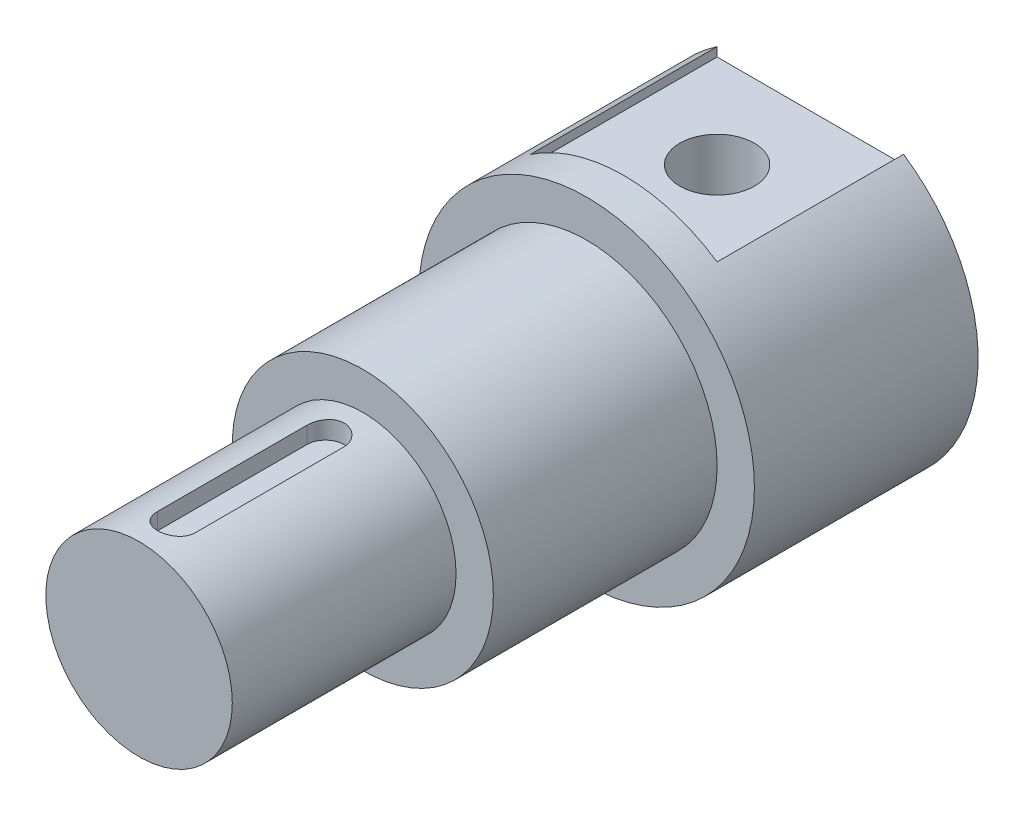
ISO-10303-21;
HEADER;
FILE_DESCRIPTION(('STEP AP214'),'2;1');
FILE_NAME('part.step','',(''),(''),'','','');
FILE_SCHEMA(('AUTOMOTIVE_DESIGN { 1 0 10303 214 1 1 1 1 }'));
ENDSEC;
DATA;
#1=APPLICATION_CONTEXT('core data for automotive mechanical design processes');
#2=APPLICATION_PROTOCOL_DEFINITION('international standard','automotive_design',2000,#1);
#3=PRODUCT_CONTEXT('',#1,'mechanical');
#4=PRODUCT('Part','Part','',(#3));
#5=PRODUCT_RELATED_PRODUCT_CATEGORY('part','',(#4));
#6=PRODUCT_DEFINITION_FORMATION('','',#4);
#7=PRODUCT_DEFINITION_CONTEXT('part definition',#1,'design');
#8=PRODUCT_DEFINITION('design','',#6,#7);
#9=PRODUCT_DEFINITION_SHAPE('','',#8);
#10=(LENGTH_UNIT() NAMED_UNIT(*) SI_UNIT(.MILLI.,.METRE.));
#11=(NAMED_UNIT(*) PLANE_ANGLE_UNIT() SI_UNIT($,.RADIAN.));
#12=(NAMED_UNIT(*) SI_UNIT($,.STERADIAN.) SOLID_ANGLE_UNIT());
#13=UNCERTAINTY_MEASURE_WITH_UNIT(LENGTH_MEASURE(1.E-05),#10,'distance_accuracy_value','');
#14=(GEOMETRIC_REPRESENTATION_CONTEXT(3) GLOBAL_UNCERTAINTY_ASSIGNED_CONTEXT((#13)) GLOBAL_UNIT_ASSIGNED_CONTEXT((#10,
#11,#12)) REPRESENTATION_CONTEXT('',''));
#15=CARTESIAN_POINT('',(0.,0.,0.));
#16=DIRECTION('',(0.,0.,1.));
#17=DIRECTION('',(1.,0.,0.));
#18=AXIS2_PLACEMENT_3D('',#15,#16,#17);
#19=CARTESIAN_POINT('',(0.,0.,24.));
#20=DIRECTION('',(0.,0.,-1.));
#21=DIRECTION('',(-1.,0.,0.));
#22=AXIS2_PLACEMENT_3D('',#19,#20,#21);
#23=CYLINDRICAL_SURFACE('',#22,18.);
#24=CARTESIAN_POINT('',(0.,0.,24.));
#25=DIRECTION('',(0.,0.,1.));
#26=DIRECTION('',(1.,0.,0.));
#27=AXIS2_PLACEMENT_3D('',#24,#25,#26);
#28=CIRCLE('',#27,18.);
#29=CARTESIAN_POINT('',(18.,0.,24.));
#30=VERTEX_POINT('',#29);
#31=EDGE_CURVE('E309',#30,#30,#28,.T.);
#32=ORIENTED_EDGE('',*,*,#31,.F.);
#33=EDGE_LOOP('',(#32));
#34=FACE_BOUND('',#33,.T.);
#35=CARTESIAN_POINT('',(0.,0.,20.));
#36=DIRECTION('',(0.,0.,-1.));
#37=DIRECTION('',(-1.,0.,0.));
#38=AXIS2_PLACEMENT_3D('',#35,#36,#37);
#39=CIRCLE('',#38,18.);
#40=CARTESIAN_POINT('',(10.,-14.9666295470958,20.));
#41=VERTEX_POINT('',#40);
#42=CARTESIAN_POINT('',(-10.,-14.9666295470958,20.));
#43=VERTEX_POINT('',#42);
#44=EDGE_CURVE('E11',#41,#43,#39,.T.);
#45=ORIENTED_EDGE('',*,*,#44,.F.);
#46=DIRECTION('',(0.,0.,-1.));
#47=VECTOR('',#46,1.);
#48=CARTESIAN_POINT('',(10.,-14.9666295470958,24.));
#49=LINE('',#48,#47);
#50=CARTESIAN_POINT('',(10.,-14.9666295470958,0.));
#51=VERTEX_POINT('',#50);
#52=EDGE_CURVE('E182',#51,#41,#49,.F.);
#53=ORIENTED_EDGE('',*,*,#52,.F.);
#54=CARTESIAN_POINT('',(0.,0.,0.));
#55=DIRECTION('',(0.,0.,1.));
#56=DIRECTION('',(1.,0.,0.));
#57=AXIS2_PLACEMENT_3D('',#54,#55,#56);
#58=CIRCLE('',#57,18.);
#59=CARTESIAN_POINT('',(10.,14.9666295470958,0.));
#60=VERTEX_POINT('',#59);
#61=EDGE_CURVE('E305',#51,#60,#58,.T.);
#62=ORIENTED_EDGE('',*,*,#61,.T.);
#63=DIRECTION('',(0.,0.,-1.));
#64=VECTOR('',#63,1.);
#65=CARTESIAN_POINT('',(10.,14.9666295470958,24.));
#66=LINE('',#65,#64);
#67=CARTESIAN_POINT('',(10.,14.9666295470958,20.));
#68=VERTEX_POINT('',#67);
#69=EDGE_CURVE('E212',#60,#68,#66,.F.);
#70=ORIENTED_EDGE('',*,*,#69,.T.);
#71=CARTESIAN_POINT('',(0.,0.,20.));
#72=DIRECTION('',(0.,0.,1.));
#73=DIRECTION('',(1.,0.,0.));
#74=AXIS2_PLACEMENT_3D('',#71,#72,#73);
#75=CIRCLE('',#74,18.);
#76=CARTESIAN_POINT('',(-10.,14.9666295470958,20.));
#77=VERTEX_POINT('',#76);
#78=EDGE_CURVE('E55',#68,#77,#75,.T.);
#79=ORIENTED_EDGE('',*,*,#78,.T.);
#80=DIRECTION('',(0.,0.,-1.));
#81=VECTOR('',#80,1.);
#82=CARTESIAN_POINT('',(-10.,14.9666295470958,24.));
#83=LINE('',#82,#81);
#84=CARTESIAN_POINT('',(-10.,14.9666295470958,0.));
#85=VERTEX_POINT('',#84);
#86=EDGE_CURVE('E227',#77,#85,#83,.T.);
#87=ORIENTED_EDGE('',*,*,#86,.T.);
#88=CARTESIAN_POINT('',(-10.,-14.9666295470958,0.));
#89=VERTEX_POINT('',#88);
#90=EDGE_CURVE('E313',#85,#89,#58,.T.);
#91=ORIENTED_EDGE('',*,*,#90,.T.);
#92=DIRECTION('',(0.,0.,-1.));
#93=VECTOR('',#92,1.);
#94=CARTESIAN_POINT('',(-10.,-14.9666295470958,24.));
#95=LINE('',#94,#93);
#96=EDGE_CURVE('E188',#43,#89,#95,.T.);
#97=ORIENTED_EDGE('',*,*,#96,.F.);
#98=EDGE_LOOP('',(#45,#53,#62,#70,#79,#87,#91,#97));
#99=FACE_BOUND('',#98,.T.);
#100=ADVANCED_FACE('F47',(#34,#99),#23,.T.);
#101=CARTESIAN_POINT('',(0.,0.,0.));
#102=DIRECTION('',(0.,0.,1.));
#103=DIRECTION('',(1.,0.,0.));
#104=AXIS2_PLACEMENT_3D('',#101,#102,#103);
#105=PLANE('',#104);
#106=DIRECTION('',(0.,-1.,0.));
#107=VECTOR('',#106,1.);
#108=CARTESIAN_POINT('',(-10.,-14.,0.));
#109=LINE('',#108,#107);
#110=CARTESIAN_POINT('',(-10.,-14.,0.));
#111=VERTEX_POINT('',#110);
#112=EDGE_CURVE('E175',#111,#89,#109,.T.);
#113=ORIENTED_EDGE('',*,*,#112,.T.);
#114=ORIENTED_EDGE('',*,*,#90,.F.);
#115=DIRECTION('',(0.,1.,0.));
#116=VECTOR('',#115,1.);
#117=CARTESIAN_POINT('',(-10.,14.,0.));
#118=LINE('',#117,#116);
#119=CARTESIAN_POINT('',(-10.,14.,0.));
#120=VERTEX_POINT('',#119);
#121=EDGE_CURVE('E209',#120,#85,#118,.T.);
#122=ORIENTED_EDGE('',*,*,#121,.F.);
#123=DIRECTION('',(-1.,0.,0.));
#124=VECTOR('',#123,1.);
#125=CARTESIAN_POINT('',(-10.,14.,0.));
#126=LINE('',#125,#124);
#127=CARTESIAN_POINT('',(10.,14.,0.));
#128=VERTEX_POINT('',#127);
#129=EDGE_CURVE('E205',#128,#120,#126,.T.);
#130=ORIENTED_EDGE('',*,*,#129,.F.);
#131=DIRECTION('',(0.,1.,0.));
#132=VECTOR('',#131,1.);
#133=CARTESIAN_POINT('',(10.,14.,0.));
#134=LINE('',#133,#132);
#135=EDGE_CURVE('E213',#128,#60,#134,.T.);
#136=ORIENTED_EDGE('',*,*,#135,.T.);
#137=ORIENTED_EDGE('',*,*,#61,.F.);
#138=DIRECTION('',(0.,-1.,0.));
#139=VECTOR('',#138,1.);
#140=CARTESIAN_POINT('',(10.,-14.,0.));
#141=LINE('',#140,#139);
#142=CARTESIAN_POINT('',(10.,-14.,0.));
#143=VERTEX_POINT('',#142);
#144=EDGE_CURVE('E190',#143,#51,#141,.T.);
#145=ORIENTED_EDGE('',*,*,#144,.F.);
#146=DIRECTION('',(-1.,0.,0.));
#147=VECTOR('',#146,1.);
#148=CARTESIAN_POINT('',(-10.,-14.,0.));
#149=LINE('',#148,#147);
#150=EDGE_CURVE('E379',#143,#111,#149,.T.);
#151=ORIENTED_EDGE('',*,*,#150,.T.);
#152=EDGE_LOOP('',(#113,#114,#122,#130,#136,#137,#145,#151));
#153=FACE_BOUND('',#152,.T.);
#154=ADVANCED_FACE('F363',(#153),#105,.F.);
#155=CARTESIAN_POINT('',(0.,0.,72.));
#156=DIRECTION('',(0.,0.,-1.));
#157=DIRECTION('',(-1.,0.,0.));
#158=AXIS2_PLACEMENT_3D('',#155,#156,#157);
#159=CYLINDRICAL_SURFACE('',#158,10.);
#160=DIRECTION('',(0.,0.,-1.));
#161=VECTOR('',#160,1.);
#162=CARTESIAN_POINT('',(2.00000000000001,9.79795897113271,72.));
#163=LINE('',#162,#161);
#164=CARTESIAN_POINT('',(2.00000000000002,9.79795897113271,52.));
#165=VERTEX_POINT('',#164);
#166=CARTESIAN_POINT('',(2.00000000000001,9.79795897113271,68.));
#167=VERTEX_POINT('',#166);
#168=EDGE_CURVE('E450',#165,#167,#163,.F.);
#169=ORIENTED_EDGE('',*,*,#168,.T.);
#170=CARTESIAN_POINT('',(2.00000000000002,9.79795897113271,68.));
#171=CARTESIAN_POINT('',(2.00000029709048,9.79795611157838,68.0556671372987));
#172=CARTESIAN_POINT('',(1.99767440405644,9.79843398465431,68.1113070388049));
#173=CARTESIAN_POINT('',(1.9883998682916,9.80032138150132,68.2221774356675));
#174=CARTESIAN_POINT('',(1.98145179742021,9.80173079002197,68.2774079808152));
#175=CARTESIAN_POINT('',(1.95376239954906,9.8073028328515,68.4417098803016));
#176=CARTESIAN_POINT('',(1.9261755529756,9.81280956758554,68.5496628575345));
#177=CARTESIAN_POINT('',(1.85359362042641,9.8267766040168,68.7592851934839));
#178=CARTESIAN_POINT('',(1.8085966127526,9.83523723174863,68.8609538571135));
#179=CARTESIAN_POINT('',(1.70250820881973,9.85415440257657,69.0553297677597));
#180=CARTESIAN_POINT('',(1.64141514447464,9.86461115250626,69.1480360846177));
#181=CARTESIAN_POINT('',(1.50396101869287,9.88650550448304,69.3231196733701));
#182=CARTESIAN_POINT('',(1.42741780364328,9.89795377776164,69.4053525644588));
#183=CARTESIAN_POINT('',(1.26162118198371,9.92044851228358,69.5559088785751));
#184=CARTESIAN_POINT('',(1.17236580968337,9.93149491105252,69.624230146461));
#185=CARTESIAN_POINT('',(0.9827201068006,9.95205620855081,69.7455778018475));
#186=CARTESIAN_POINT('',(0.882239649549993,9.96155694564014,69.7984659384246));
#187=CARTESIAN_POINT('',(0.673602404217804,9.97783510908995,69.8865517690996));
#188=CARTESIAN_POINT('',(0.565446754297834,9.9846129382442,69.9217520799118));
#189=CARTESIAN_POINT('',(0.34603481777421,9.99460635553984,69.9730140969379));
#190=CARTESIAN_POINT('',(0.234838069152001,9.99786765043076,69.9893215789678));
#191=CARTESIAN_POINT('',(0.0112397534982689,10.0006184349224,70.0031019588768));
#192=CARTESIAN_POINT('',(-0.10116172478384,10.000108200481,70.0005762347569));
#193=CARTESIAN_POINT('',(-0.322284405513379,9.99540868887644,69.9769475992568));
#194=CARTESIAN_POINT('',(-0.431035226714456,9.9912719366342,69.9561099001905));
#195=CARTESIAN_POINT('',(-0.643464013108165,9.97984349003516,69.8968696460479));
#196=CARTESIAN_POINT('',(-0.747141812282543,9.97255169250401,69.8584665165555));
#197=CARTESIAN_POINT('',(-0.947240542625918,9.95554578241051,69.7649391930093));
#198=CARTESIAN_POINT('',(-1.04361145363294,9.94581664782192,69.7097108261481));
#199=CARTESIAN_POINT('',(-1.22581287576612,9.92500903258345,69.5841794594467));
#200=CARTESIAN_POINT('',(-1.31164251244036,9.91393044014086,69.5138752103125));
#201=CARTESIAN_POINT('',(-1.47189241307715,9.8914207473701,69.3587432767496));
#202=CARTESIAN_POINT('',(-1.54608938999208,9.8799868648348,69.2736851958569));
#203=CARTESIAN_POINT('',(-1.6792217997989,9.85823412232848,69.0921904830223));
#204=CARTESIAN_POINT('',(-1.73815300484307,9.84791557170815,68.9957507096675));
#205=CARTESIAN_POINT('',(-1.83915990928954,9.82955460084642,68.7938951901082));
#206=CARTESIAN_POINT('',(-1.88118975326901,9.8215183899669,68.6884559532069));
#207=CARTESIAN_POINT('',(-1.94681419465983,9.80872322124987,68.4718827374886));
#208=CARTESIAN_POINT('',(-1.97043625496866,9.80395938256574,68.3607575067038));
#209=CARTESIAN_POINT('',(-1.98966587624393,9.80006354383926,68.2072863663072));
#210=CARTESIAN_POINT('',(-1.99354251131102,9.79927519743986,68.1658917204352));
#211=CARTESIAN_POINT('',(-1.9987063293293,9.79822334773544,68.0830042717252));
#212=CARTESIAN_POINT('',(-1.99999784580931,9.79795896609649,68.0415117500884));
#213=CARTESIAN_POINT('',(-2.,9.79795897113271,68.));
#214=B_SPLINE_CURVE_WITH_KNOTS('',3,(#170,#171,#172,#173,#174,#175,#176,#177,#178,#179,#180,
#181,#182,#183,#184,#185,#186,#187,#188,#189,#190,#191,#192,#193,#194,#195,#196,#197,#198,#199,
#200,#201,#202,#203,#204,#205,#206,#207,#208,#209,#210,#211,#212,#213),.UNSPECIFIED.,.F.,.F.,(4,
2,2,2,2,2,2,2,2,2,2,2,2,2,2,2,2,2,2,2,2,4),(0.,0.166897020715831,0.333773396643063,
0.666722601037227,0.999708566174129,1.33272905329864,1.6699328893144,2.00718892413593,
2.34737937755196,2.68751948879681,3.02318320738909,3.35882236614865,3.6896791255544,
4.02054670525123,4.35350597112355,4.6864928390181,5.02524540329294,5.36409168485664,
5.70385119298731,6.04310283225107,6.16778801087552,6.292263999539),.UNSPECIFIED.);
#215=CARTESIAN_POINT('',(-2.,9.79795897113271,68.));
#216=VERTEX_POINT('',#215);
#217=EDGE_CURVE('E300',#167,#216,#214,.T.);
#218=ORIENTED_EDGE('',*,*,#217,.T.);
#219=DIRECTION('',(0.,0.,-1.));
#220=VECTOR('',#219,1.);
#221=CARTESIAN_POINT('',(-2.00000000000001,9.79795897113271,72.));
#222=LINE('',#221,#220);
#223=CARTESIAN_POINT('',(-2.00000000000001,9.79795897113271,52.));
#224=VERTEX_POINT('',#223);
#225=EDGE_CURVE('E478',#216,#224,#222,.T.);
#226=ORIENTED_EDGE('',*,*,#225,.T.);
#227=CARTESIAN_POINT('',(-2.,9.79795897113271,52.));
#228=CARTESIAN_POINT('',(-2.00000029709046,9.79795611157838,51.9443328627013));
#229=CARTESIAN_POINT('',(-1.99767440405642,9.79843398465431,51.8886929611951));
#230=CARTESIAN_POINT('',(-1.98839986829158,9.80032138150132,51.7778225643325));
#231=CARTESIAN_POINT('',(-1.98145179742019,9.80173079002197,51.7225920191848));
#232=CARTESIAN_POINT('',(-1.95376239954903,9.8073028328515,51.5582901196984));
#233=CARTESIAN_POINT('',(-1.92617555297558,9.81280956758554,51.4503371424655));
#234=CARTESIAN_POINT('',(-1.85359362042638,9.8267766040168,51.2407148065161));
#235=CARTESIAN_POINT('',(-1.80859661275257,9.83523723174864,51.1390461428865));
#236=CARTESIAN_POINT('',(-1.7025082088197,9.85415440257657,50.9446702322403));
#237=CARTESIAN_POINT('',(-1.64141514447461,9.86461115250626,50.8519639153823));
#238=CARTESIAN_POINT('',(-1.50396101869285,9.88650550448304,50.6768803266299));
#239=CARTESIAN_POINT('',(-1.42741780364326,9.89795377776164,50.5946474355412));
#240=CARTESIAN_POINT('',(-1.26162118198369,9.92044851228359,50.4440911214249));
#241=CARTESIAN_POINT('',(-1.17236580968335,9.93149491105252,50.375769853539));
#242=CARTESIAN_POINT('',(-0.982720106800585,9.95205620855081,50.2544221981525));
#243=CARTESIAN_POINT('',(-0.882239649549981,9.96155694564014,50.2015340615754));
#244=CARTESIAN_POINT('',(-0.673602404217792,9.97783510908995,50.1134482309004));
#245=CARTESIAN_POINT('',(-0.565446754297821,9.9846129382442,50.0782479200882));
#246=CARTESIAN_POINT('',(-0.346034817774195,9.99460635553984,50.0269859030621));
#247=CARTESIAN_POINT('',(-0.234838069151986,9.99786765043076,50.0106784210322));
#248=CARTESIAN_POINT('',(-0.0112397534982542,10.0006184349224,49.9968980411232));
#249=CARTESIAN_POINT('',(0.101161724783855,10.000108200481,49.9994237652431));
#250=CARTESIAN_POINT('',(0.322284405513394,9.99540868887644,50.0230524007432));
#251=CARTESIAN_POINT('',(0.431035226714469,9.9912719366342,50.0438900998095));
#252=CARTESIAN_POINT('',(0.643464013108179,9.97984349003515,50.1031303539521));
#253=CARTESIAN_POINT('',(0.747141812282559,9.97255169250401,50.1415334834445));
#254=CARTESIAN_POINT('',(0.947240542625932,9.95554578241051,50.2350608069907));
#255=CARTESIAN_POINT('',(1.04361145363296,9.94581664782193,50.2902891738519));
#256=CARTESIAN_POINT('',(1.22581287576613,9.92500903258345,50.4158205405533));
#257=CARTESIAN_POINT('',(1.31164251244038,9.91393044014085,50.4861247896875));
#258=CARTESIAN_POINT('',(1.47189241307717,9.89142074737009,50.6412567232504));
#259=CARTESIAN_POINT('',(1.5460893899921,9.87998686483479,50.7263148041431));
#260=CARTESIAN_POINT('',(1.67922179979891,9.85823412232847,50.9078095169778));
#261=CARTESIAN_POINT('',(1.73815300484308,9.84791557170815,51.0042492903325));
#262=CARTESIAN_POINT('',(1.83915990928956,9.82955460084642,51.2061048098918));
#263=CARTESIAN_POINT('',(1.88118975326902,9.8215183899669,51.3115440467931));
#264=CARTESIAN_POINT('',(1.94681419465985,9.80872322124987,51.5281172625114));
#265=CARTESIAN_POINT('',(1.97043625496868,9.80395938256574,51.6392424932963));
#266=CARTESIAN_POINT('',(1.98966587624396,9.80006354383926,51.7927136336929));
#267=CARTESIAN_POINT('',(1.99354251131105,9.79927519743985,51.8341082795649));
#268=CARTESIAN_POINT('',(1.99870632932933,9.79822334773543,51.9169957282748));
#269=CARTESIAN_POINT('',(1.99999784580933,9.79795896609649,51.9584882499116));
#270=CARTESIAN_POINT('',(2.00000000000002,9.79795897113271,52.));
#271=B_SPLINE_CURVE_WITH_KNOTS('',3,(#227,#228,#229,#230,#231,#232,#233,#234,#235,#236,#237,
#238,#239,#240,#241,#242,#243,#244,#245,#246,#247,#248,#249,#250,#251,#252,#253,#254,#255,#256,
#257,#258,#259,#260,#261,#262,#263,#264,#265,#266,#267,#268,#269,#270),.UNSPECIFIED.,.F.,.F.,(4,
2,2,2,2,2,2,2,2,2,2,2,2,2,2,2,2,2,2,2,2,4),(0.,0.166897020715838,0.33377339664307,
0.666722601037227,0.999708566174154,1.33272905329864,1.6699328893144,2.00718892413592,
2.34737937755194,2.6875194887968,3.02318320738908,3.35882236614864,3.68967912555439,
4.02054670525122,4.35350597112354,4.68649283901809,5.02524540329295,5.36409168485662,
5.7038511929873,6.04310283225108,6.16778801087555,6.29226399953903),.UNSPECIFIED.);
#272=EDGE_CURVE('E326',#224,#165,#271,.T.);
#273=ORIENTED_EDGE('',*,*,#272,.T.);
#274=EDGE_LOOP('',(#169,#218,#226,#273));
#275=FACE_BOUND('',#274,.T.);
#276=CARTESIAN_POINT('',(0.,0.,72.));
#277=DIRECTION('',(0.,0.,1.));
#278=DIRECTION('',(1.,0.,0.));
#279=AXIS2_PLACEMENT_3D('',#276,#277,#278);
#280=CIRCLE('',#279,10.);
#281=CARTESIAN_POINT('',(10.,0.,72.));
#282=VERTEX_POINT('',#281);
#283=EDGE_CURVE('E280',#282,#282,#280,.T.);
#284=ORIENTED_EDGE('',*,*,#283,.F.);
#285=EDGE_LOOP('',(#284));
#286=FACE_BOUND('',#285,.T.);
#287=CARTESIAN_POINT('',(0.,0.,48.));
#288=DIRECTION('',(0.,0.,1.));
#289=DIRECTION('',(1.,0.,0.));
#290=AXIS2_PLACEMENT_3D('',#287,#288,#289);
#291=CIRCLE('',#290,10.);
#292=CARTESIAN_POINT('',(10.,0.,48.));
#293=VERTEX_POINT('',#292);
#294=EDGE_CURVE('E296',#293,#293,#291,.T.);
#295=ORIENTED_EDGE('',*,*,#294,.T.);
#296=EDGE_LOOP('',(#295));
#297=FACE_BOUND('',#296,.T.);
#298=CARTESIAN_POINT('',(-2.,-9.79795897113271,52.));
#299=CARTESIAN_POINT('',(-2.00000029709046,-9.79795611157838,51.9443328627013));
#300=CARTESIAN_POINT('',(-1.99767440405642,-9.79843398465431,51.8886929611951));
#301=CARTESIAN_POINT('',(-1.98839986829158,-9.80032138150132,51.7778225643325));
#302=CARTESIAN_POINT('',(-1.98145179742019,-9.80173079002197,51.7225920191848));
#303=CARTESIAN_POINT('',(-1.95376239954903,-9.8073028328515,51.5582901196984));
#304=CARTESIAN_POINT('',(-1.92617555297558,-9.81280956758554,51.4503371424655));
#305=CARTESIAN_POINT('',(-1.85359362042638,-9.8267766040168,51.2407148065161));
#306=CARTESIAN_POINT('',(-1.80859661275257,-9.83523723174864,51.1390461428865));
#307=CARTESIAN_POINT('',(-1.7025082088197,-9.85415440257657,50.9446702322403));
#308=CARTESIAN_POINT('',(-1.64141514447462,-9.86461115250626,50.8519639153823));
#309=CARTESIAN_POINT('',(-1.50396101869285,-9.88650550448304,50.6768803266299));
#310=CARTESIAN_POINT('',(-1.42741780364327,-9.89795377776164,50.5946474355412));
#311=CARTESIAN_POINT('',(-1.26162118198369,-9.92044851228358,50.4440911214249));
#312=CARTESIAN_POINT('',(-1.17236580968335,-9.93149491105252,50.375769853539));
#313=CARTESIAN_POINT('',(-0.982720106800585,-9.95205620855081,50.2544221981525));
#314=CARTESIAN_POINT('',(-0.882239649549979,-9.96155694564014,50.2015340615754));
#315=CARTESIAN_POINT('',(-0.673602404217791,-9.97783510908995,50.1134482309004));
#316=CARTESIAN_POINT('',(-0.565446754297822,-9.9846129382442,50.0782479200882));
#317=CARTESIAN_POINT('',(-0.346034817774198,-9.99460635553984,50.0269859030621));
#318=CARTESIAN_POINT('',(-0.23483806915199,-9.99786765043076,50.0106784210322));
#319=CARTESIAN_POINT('',(-0.0112397534982588,-10.0006184349224,49.9968980411232));
#320=CARTESIAN_POINT('',(0.101161724783849,-10.000108200481,49.9994237652431));
#321=CARTESIAN_POINT('',(0.322284405513387,-9.99540868887644,50.0230524007432));
#322=CARTESIAN_POINT('',(0.431035226714462,-9.9912719366342,50.0438900998095));
#323=CARTESIAN_POINT('',(0.64346401310817,-9.97984349003516,50.1031303539521));
#324=CARTESIAN_POINT('',(0.747141812282548,-9.97255169250401,50.1415334834445));
#325=CARTESIAN_POINT('',(0.94724054262592,-9.95554578241051,50.2350608069907));
#326=CARTESIAN_POINT('',(1.04361145363294,-9.94581664782193,50.2902891738519));
#327=CARTESIAN_POINT('',(1.22581287576612,-9.92500903258345,50.4158205405534));
#328=CARTESIAN_POINT('',(1.31164251244036,-9.91393044014086,50.4861247896875));
#329=CARTESIAN_POINT('',(1.47189241307715,-9.89142074737009,50.6412567232504));
#330=CARTESIAN_POINT('',(1.54608938999209,-9.87998686483479,50.7263148041431));
#331=CARTESIAN_POINT('',(1.6792217997989,-9.85823412232847,50.9078095169778));
#332=CARTESIAN_POINT('',(1.73815300484307,-9.84791557170815,51.0042492903325));
#333=CARTESIAN_POINT('',(1.83915990928954,-9.82955460084642,51.2061048098918));
#334=CARTESIAN_POINT('',(1.881189753269,-9.8215183899669,51.3115440467931));
#335=CARTESIAN_POINT('',(1.94681419465983,-9.80872322124987,51.5281172625114));
#336=CARTESIAN_POINT('',(1.97043625496866,-9.80395938256574,51.6392424932963));
#337=CARTESIAN_POINT('',(1.98966587624393,-9.80006354383926,51.7927136336929));
#338=CARTESIAN_POINT('',(1.99354251131102,-9.79927519743986,51.8341082795649));
#339=CARTESIAN_POINT('',(1.9987063293293,-9.79822334773544,51.9169957282748));
#340=CARTESIAN_POINT('',(1.99999784580931,-9.79795896609649,51.9584882499116));
#341=CARTESIAN_POINT('',(2.,-9.79795897113271,52.));
#342=B_SPLINE_CURVE_WITH_KNOTS('',3,(#298,#299,#300,#301,#302,#303,#304,#305,#306,#307,#308,
#309,#310,#311,#312,#313,#314,#315,#316,#317,#318,#319,#320,#321,#322,#323,#324,#325,#326,#327,
#328,#329,#330,#331,#332,#333,#334,#335,#336,#337,#338,#339,#340,#341),.UNSPECIFIED.,.F.,.F.,(4,
2,2,2,2,2,2,2,2,2,2,2,2,2,2,2,2,2,2,2,2,4),(0.,0.166897020715838,0.333773396643063,
0.666722601037227,0.999708566174138,1.33272905329864,1.66993288931439,2.00718892413592,
2.34737937755194,2.68751948879679,3.02318320738907,3.35882236614863,3.68967912555437,
4.0205467052512,4.35350597112352,4.68649283901807,5.02524540329293,5.3640916848566,
5.70385119298728,6.04310283225105,6.16778801087552,6.29226399953898),.UNSPECIFIED.);
#343=CARTESIAN_POINT('',(-2.,-9.79795897113271,52.));
#344=VERTEX_POINT('',#343);
#345=CARTESIAN_POINT('',(2.,-9.79795897113271,52.));
#346=VERTEX_POINT('',#345);
#347=EDGE_CURVE('E441',#344,#346,#342,.T.);
#348=ORIENTED_EDGE('',*,*,#347,.F.);
#349=DIRECTION('',(0.,0.,-1.));
#350=VECTOR('',#349,1.);
#351=CARTESIAN_POINT('',(-2.,-9.79795897113271,72.));
#352=LINE('',#351,#350);
#353=CARTESIAN_POINT('',(-2.,-9.79795897113271,68.));
#354=VERTEX_POINT('',#353);
#355=EDGE_CURVE('E462',#354,#344,#352,.T.);
#356=ORIENTED_EDGE('',*,*,#355,.F.);
#357=CARTESIAN_POINT('',(2.,-9.79795897113271,68.));
#358=CARTESIAN_POINT('',(2.00000029709046,-9.79795611157838,68.0556671372987));
#359=CARTESIAN_POINT('',(1.99767440405642,-9.79843398465431,68.1113070388049));
#360=CARTESIAN_POINT('',(1.98839986829158,-9.80032138150132,68.2221774356675));
#361=CARTESIAN_POINT('',(1.98145179742019,-9.80173079002197,68.2774079808152));
#362=CARTESIAN_POINT('',(1.95376239954903,-9.8073028328515,68.4417098803016));
#363=CARTESIAN_POINT('',(1.92617555297558,-9.81280956758554,68.5496628575345));
#364=CARTESIAN_POINT('',(1.85359362042638,-9.8267766040168,68.7592851934839));
#365=CARTESIAN_POINT('',(1.80859661275257,-9.83523723174864,68.8609538571135));
#366=CARTESIAN_POINT('',(1.7025082088197,-9.85415440257657,69.0553297677597));
#367=CARTESIAN_POINT('',(1.64141514447462,-9.86461115250626,69.1480360846177));
#368=CARTESIAN_POINT('',(1.50396101869286,-9.88650550448304,69.3231196733701));
#369=CARTESIAN_POINT('',(1.42741780364327,-9.89795377776164,69.4053525644588));
#370=CARTESIAN_POINT('',(1.26162118198369,-9.92044851228358,69.5559088785751));
#371=CARTESIAN_POINT('',(1.17236580968335,-9.93149491105252,69.624230146461));
#372=CARTESIAN_POINT('',(0.982720106800583,-9.95205620855081,69.7455778018475));
#373=CARTESIAN_POINT('',(0.882239649549978,-9.96155694564014,69.7984659384246));
#374=CARTESIAN_POINT('',(0.673602404217792,-9.97783510908995,69.8865517690996));
#375=CARTESIAN_POINT('',(0.565446754297823,-9.9846129382442,69.9217520799118));
#376=CARTESIAN_POINT('',(0.3460348177742,-9.99460635553984,69.9730140969379));
#377=CARTESIAN_POINT('',(0.234838069151992,-9.99786765043076,69.9893215789678));
#378=CARTESIAN_POINT('',(0.0112397534982605,-10.0006184349224,70.0031019588768));
#379=CARTESIAN_POINT('',(-0.101161724783848,-10.000108200481,70.0005762347569));
#380=CARTESIAN_POINT('',(-0.322284405513385,-9.99540868887644,69.9769475992568));
#381=CARTESIAN_POINT('',(-0.431035226714458,-9.9912719366342,69.9561099001905));
#382=CARTESIAN_POINT('',(-0.643464013108167,-9.97984349003516,69.8968696460479));
#383=CARTESIAN_POINT('',(-0.747141812282547,-9.97255169250401,69.8584665165555));
#384=CARTESIAN_POINT('',(-0.947240542625918,-9.95554578241051,69.7649391930093));
#385=CARTESIAN_POINT('',(-1.04361145363294,-9.94581664782193,69.7097108261481));
#386=CARTESIAN_POINT('',(-1.22581287576612,-9.92500903258345,69.5841794594466));
#387=CARTESIAN_POINT('',(-1.31164251244036,-9.91393044014086,69.5138752103125));
#388=CARTESIAN_POINT('',(-1.47189241307715,-9.8914207473701,69.3587432767496));
#389=CARTESIAN_POINT('',(-1.54608938999208,-9.8799868648348,69.2736851958569));
#390=CARTESIAN_POINT('',(-1.67922179979889,-9.85823412232848,69.0921904830222));
#391=CARTESIAN_POINT('',(-1.73815300484306,-9.84791557170815,68.9957507096675));
#392=CARTESIAN_POINT('',(-1.83915990928954,-9.82955460084642,68.7938951901082));
#393=CARTESIAN_POINT('',(-1.881189753269,-9.8215183899669,68.6884559532069));
#394=CARTESIAN_POINT('',(-1.94681419465982,-9.80872322124987,68.4718827374886));
#395=CARTESIAN_POINT('',(-1.97043625496865,-9.80395938256574,68.3607575067038));
#396=CARTESIAN_POINT('',(-1.98966587624393,-9.80006354383926,68.2072863663072));
#397=CARTESIAN_POINT('',(-1.99354251131102,-9.79927519743986,68.1658917204352));
#398=CARTESIAN_POINT('',(-1.9987063293293,-9.79822334773544,68.0830042717252));
#399=CARTESIAN_POINT('',(-1.99999784580931,-9.79795896609649,68.0415117500884));
#400=CARTESIAN_POINT('',(-2.,-9.79795897113271,68.));
#401=B_SPLINE_CURVE_WITH_KNOTS('',3,(#357,#358,#359,#360,#361,#362,#363,#364,#365,#366,#367,
#368,#369,#370,#371,#372,#373,#374,#375,#376,#377,#378,#379,#380,#381,#382,#383,#384,#385,#386,
#387,#388,#389,#390,#391,#392,#393,#394,#395,#396,#397,#398,#399,#400),.UNSPECIFIED.,.F.,.F.,(4,
2,2,2,2,2,2,2,2,2,2,2,2,2,2,2,2,2,2,2,2,4),(0.,0.166897020715831,0.333773396643063,
0.666722601037227,0.999708566174145,1.33272905329863,1.66993288931438,2.00718892413592,
2.34737937755194,2.68751948879679,3.02318320738907,3.35882236614863,3.68967912555437,
4.02054670525121,4.35350597112352,4.68649283901806,5.02524540329292,5.3640916848566,
5.70385119298727,6.04310283225103,6.16778801087549,6.29226399953896),.UNSPECIFIED.);
#402=CARTESIAN_POINT('',(2.,-9.79795897113271,68.));
#403=VERTEX_POINT('',#402);
#404=EDGE_CURVE('E454',#403,#354,#401,.T.);
#405=ORIENTED_EDGE('',*,*,#404,.F.);
#406=DIRECTION('',(0.,0.,-1.));
#407=VECTOR('',#406,1.);
#408=CARTESIAN_POINT('',(2.,-9.79795897113271,72.));
#409=LINE('',#408,#407);
#410=EDGE_CURVE('E449',#346,#403,#409,.F.);
#411=ORIENTED_EDGE('',*,*,#410,.F.);
#412=EDGE_LOOP('',(#348,#356,#405,#411));
#413=FACE_BOUND('',#412,.T.);
#414=ADVANCED_FACE('F333',(#275,#286,#297,#413),#159,.T.);
#415=CARTESIAN_POINT('',(0.,0.,24.));
#416=DIRECTION('',(0.,0.,1.));
#417=DIRECTION('',(1.,0.,0.));
#418=AXIS2_PLACEMENT_3D('',#415,#416,#417);
#419=PLANE('',#418);
#420=CARTESIAN_POINT('',(0.,0.,24.));
#421=DIRECTION('',(0.,0.,1.));
#422=DIRECTION('',(1.,0.,0.));
#423=AXIS2_PLACEMENT_3D('',#420,#421,#422);
#424=CIRCLE('',#423,14.);
#425=CARTESIAN_POINT('',(14.,0.,24.));
#426=VERTEX_POINT('',#425);
#427=EDGE_CURVE('E301',#426,#426,#424,.T.);
#428=ORIENTED_EDGE('',*,*,#427,.F.);
#429=EDGE_LOOP('',(#428));
#430=FACE_BOUND('',#429,.T.);
#431=ORIENTED_EDGE('',*,*,#31,.T.);
#432=EDGE_LOOP('',(#431));
#433=FACE_BOUND('',#432,.T.);
#434=ADVANCED_FACE('F486',(#430,#433),#419,.T.);
#435=CARTESIAN_POINT('',(0.,0.,48.));
#436=DIRECTION('',(0.,0.,-1.));
#437=DIRECTION('',(-1.,0.,0.));
#438=AXIS2_PLACEMENT_3D('',#435,#436,#437);
#439=CYLINDRICAL_SURFACE('',#438,14.);
#440=CARTESIAN_POINT('',(0.,0.,48.));
#441=DIRECTION('',(0.,0.,1.));
#442=DIRECTION('',(1.,0.,0.));
#443=AXIS2_PLACEMENT_3D('',#440,#441,#442);
#444=CIRCLE('',#443,14.);
#445=CARTESIAN_POINT('',(14.,0.,48.));
#446=VERTEX_POINT('',#445);
#447=EDGE_CURVE('E295',#446,#446,#444,.T.);
#448=ORIENTED_EDGE('',*,*,#447,.F.);
#449=EDGE_LOOP('',(#448));
#450=FACE_BOUND('',#449,.T.);
#451=ORIENTED_EDGE('',*,*,#427,.T.);
#452=EDGE_LOOP('',(#451));
#453=FACE_BOUND('',#452,.T.);
#454=ADVANCED_FACE('F360',(#450,#453),#439,.T.);
#455=CARTESIAN_POINT('',(0.,0.,48.));
#456=DIRECTION('',(0.,0.,1.));
#457=DIRECTION('',(1.,0.,0.));
#458=AXIS2_PLACEMENT_3D('',#455,#456,#457);
#459=PLANE('',#458);
#460=ORIENTED_EDGE('',*,*,#294,.F.);
#461=EDGE_LOOP('',(#460));
#462=FACE_BOUND('',#461,.T.);
#463=ORIENTED_EDGE('',*,*,#447,.T.);
#464=EDGE_LOOP('',(#463));
#465=FACE_BOUND('',#464,.T.);
#466=ADVANCED_FACE('F355',(#462,#465),#459,.T.);
#467=CARTESIAN_POINT('',(0.,0.,72.));
#468=DIRECTION('',(0.,0.,1.));
#469=DIRECTION('',(1.,0.,0.));
#470=AXIS2_PLACEMENT_3D('',#467,#468,#469);
#471=PLANE('',#470);
#472=ORIENTED_EDGE('',*,*,#283,.T.);
#473=EDGE_LOOP('',(#472));
#474=FACE_BOUND('',#473,.T.);
#475=ADVANCED_FACE('F352',(#474),#471,.T.);
#476=CARTESIAN_POINT('',(0.,8.,52.));
#477=DIRECTION('',(0.,1.,0.));
#478=DIRECTION('',(0.,0.,1.));
#479=AXIS2_PLACEMENT_3D('',#476,#477,#478);
#480=CYLINDRICAL_SURFACE('',#479,2.00000000000001);
#481=DIRECTION('',(0.,1.,0.));
#482=VECTOR('',#481,1.);
#483=CARTESIAN_POINT('',(-2.00000000000001,8.,52.));
#484=LINE('',#483,#482);
#485=CARTESIAN_POINT('',(-2.00000000000001,8.,52.));
#486=VERTEX_POINT('',#485);
#487=EDGE_CURVE('E275',#486,#224,#484,.T.);
#488=ORIENTED_EDGE('',*,*,#487,.F.);
#489=CARTESIAN_POINT('',(0.,8.,52.));
#490=DIRECTION('',(0.,1.,0.));
#491=DIRECTION('',(0.,0.,1.));
#492=AXIS2_PLACEMENT_3D('',#489,#490,#491);
#493=CIRCLE('',#492,2.00000000000001);
#494=CARTESIAN_POINT('',(2.00000000000002,8.,52.));
#495=VERTEX_POINT('',#494);
#496=EDGE_CURVE('E259',#495,#486,#493,.T.);
#497=ORIENTED_EDGE('',*,*,#496,.F.);
#498=DIRECTION('',(0.,1.,0.));
#499=VECTOR('',#498,1.);
#500=CARTESIAN_POINT('',(2.00000000000002,8.,52.));
#501=LINE('',#500,#499);
#502=EDGE_CURVE('E276',#495,#165,#501,.T.);
#503=ORIENTED_EDGE('',*,*,#502,.T.);
#504=ORIENTED_EDGE('',*,*,#272,.F.);
#505=EDGE_LOOP('',(#488,#497,#503,#504));
#506=FACE_BOUND('',#505,.T.);
#507=ADVANCED_FACE('F349',(#506),#480,.F.);
#508=CARTESIAN_POINT('',(2.00000000000002,8.,52.));
#509=DIRECTION('',(1.,0.,0.));
#510=DIRECTION('',(0.,0.,-1.));
#511=AXIS2_PLACEMENT_3D('',#508,#509,#510);
#512=PLANE('',#511);
#513=ORIENTED_EDGE('',*,*,#502,.F.);
#514=DIRECTION('',(0.,0.,-1.));
#515=VECTOR('',#514,1.);
#516=CARTESIAN_POINT('',(2.00000000000002,8.,52.));
#517=LINE('',#516,#515);
#518=CARTESIAN_POINT('',(2.00000000000001,8.,68.));
#519=VERTEX_POINT('',#518);
#520=EDGE_CURVE('E271',#519,#495,#517,.T.);
#521=ORIENTED_EDGE('',*,*,#520,.F.);
#522=DIRECTION('',(0.,1.,0.));
#523=VECTOR('',#522,1.);
#524=CARTESIAN_POINT('',(2.00000000000001,8.,68.));
#525=LINE('',#524,#523);
#526=EDGE_CURVE('E281',#519,#167,#525,.T.);
#527=ORIENTED_EDGE('',*,*,#526,.T.);
#528=ORIENTED_EDGE('',*,*,#168,.F.);
#529=EDGE_LOOP('',(#513,#521,#527,#528));
#530=FACE_BOUND('',#529,.T.);
#531=ADVANCED_FACE('F343',(#530),#512,.F.);
#532=CARTESIAN_POINT('',(0.,8.,68.));
#533=DIRECTION('',(0.,1.,0.));
#534=DIRECTION('',(0.,0.,1.));
#535=AXIS2_PLACEMENT_3D('',#532,#533,#534);
#536=CYLINDRICAL_SURFACE('',#535,2.00000000000001);
#537=ORIENTED_EDGE('',*,*,#526,.F.);
#538=CARTESIAN_POINT('',(0.,8.,68.));
#539=DIRECTION('',(0.,1.,0.));
#540=DIRECTION('',(0.,0.,1.));
#541=AXIS2_PLACEMENT_3D('',#538,#539,#540);
#542=CIRCLE('',#541,2.00000000000001);
#543=CARTESIAN_POINT('',(-2.,8.,68.));
#544=VERTEX_POINT('',#543);
#545=EDGE_CURVE('E267',#544,#519,#542,.T.);
#546=ORIENTED_EDGE('',*,*,#545,.F.);
#547=DIRECTION('',(0.,1.,0.));
#548=VECTOR('',#547,1.);
#549=CARTESIAN_POINT('',(-2.,8.,68.));
#550=LINE('',#549,#548);
#551=EDGE_CURVE('E285',#544,#216,#550,.T.);
#552=ORIENTED_EDGE('',*,*,#551,.T.);
#553=ORIENTED_EDGE('',*,*,#217,.F.);
#554=EDGE_LOOP('',(#537,#546,#552,#553));
#555=FACE_BOUND('',#554,.T.);
#556=ADVANCED_FACE('F337',(#555),#536,.F.);
#557=CARTESIAN_POINT('',(-2.00000000000001,8.,52.));
#558=DIRECTION('',(-1.,0.,0.));
#559=DIRECTION('',(0.,0.,1.));
#560=AXIS2_PLACEMENT_3D('',#557,#558,#559);
#561=PLANE('',#560);
#562=ORIENTED_EDGE('',*,*,#551,.F.);
#563=DIRECTION('',(0.,0.,1.));
#564=VECTOR('',#563,1.);
#565=CARTESIAN_POINT('',(-2.00000000000001,8.,52.));
#566=LINE('',#565,#564);
#567=EDGE_CURVE('E263',#486,#544,#566,.T.);
#568=ORIENTED_EDGE('',*,*,#567,.F.);
#569=ORIENTED_EDGE('',*,*,#487,.T.);
#570=ORIENTED_EDGE('',*,*,#225,.F.);
#571=EDGE_LOOP('',(#562,#568,#569,#570));
#572=FACE_BOUND('',#571,.T.);
#573=ADVANCED_FACE('F342',(#572),#561,.F.);
#574=CARTESIAN_POINT('',(0.,8.,52.));
#575=DIRECTION('',(0.,1.,0.));
#576=DIRECTION('',(0.,0.,1.));
#577=AXIS2_PLACEMENT_3D('',#574,#575,#576);
#578=PLANE('',#577);
#579=ORIENTED_EDGE('',*,*,#496,.T.);
#580=ORIENTED_EDGE('',*,*,#567,.T.);
#581=ORIENTED_EDGE('',*,*,#545,.T.);
#582=ORIENTED_EDGE('',*,*,#520,.T.);
#583=EDGE_LOOP('',(#579,#580,#581,#582));
#584=FACE_BOUND('',#583,.T.);
#585=ADVANCED_FACE('F347',(#584),#578,.T.);
#586=CARTESIAN_POINT('',(0.,-8.,68.));
#587=DIRECTION('',(0.,-1.,0.));
#588=DIRECTION('',(0.,0.,-1.));
#589=AXIS2_PLACEMENT_3D('',#586,#587,#588);
#590=CYLINDRICAL_SURFACE('',#589,2.);
#591=DIRECTION('',(0.,-1.,0.));
#592=VECTOR('',#591,1.);
#593=CARTESIAN_POINT('',(2.,-8.,68.));
#594=LINE('',#593,#592);
#595=CARTESIAN_POINT('',(2.,-8.,68.));
#596=VERTEX_POINT('',#595);
#597=EDGE_CURVE('E255',#596,#403,#594,.T.);
#598=ORIENTED_EDGE('',*,*,#597,.T.);
#599=ORIENTED_EDGE('',*,*,#404,.T.);
#600=DIRECTION('',(0.,-1.,0.));
#601=VECTOR('',#600,1.);
#602=CARTESIAN_POINT('',(-2.,-8.,68.));
#603=LINE('',#602,#601);
#604=CARTESIAN_POINT('',(-2.,-8.,68.));
#605=VERTEX_POINT('',#604);
#606=EDGE_CURVE('E244',#605,#354,#603,.T.);
#607=ORIENTED_EDGE('',*,*,#606,.F.);
#608=CARTESIAN_POINT('',(0.,-8.,68.));
#609=DIRECTION('',(0.,1.,0.));
#610=DIRECTION('',(0.,0.,1.));
#611=AXIS2_PLACEMENT_3D('',#608,#609,#610);
#612=CIRCLE('',#611,2.);
#613=EDGE_CURVE('E231',#605,#596,#612,.T.);
#614=ORIENTED_EDGE('',*,*,#613,.T.);
#615=EDGE_LOOP('',(#598,#599,#607,#614));
#616=FACE_BOUND('',#615,.T.);
#617=ADVANCED_FACE('F463',(#616),#590,.F.);
#618=CARTESIAN_POINT('',(2.,-8.,68.));
#619=DIRECTION('',(-1.,0.,0.));
#620=DIRECTION('',(0.,0.,1.));
#621=AXIS2_PLACEMENT_3D('',#618,#619,#620);
#622=PLANE('',#621);
#623=ORIENTED_EDGE('',*,*,#410,.T.);
#624=ORIENTED_EDGE('',*,*,#597,.F.);
#625=DIRECTION('',(0.,0.,-1.));
#626=VECTOR('',#625,1.);
#627=CARTESIAN_POINT('',(2.,-8.,68.));
#628=LINE('',#627,#626);
#629=CARTESIAN_POINT('',(2.,-8.,52.));
#630=VERTEX_POINT('',#629);
#631=EDGE_CURVE('E235',#596,#630,#628,.T.);
#632=ORIENTED_EDGE('',*,*,#631,.T.);
#633=DIRECTION('',(0.,-1.,0.));
#634=VECTOR('',#633,1.);
#635=CARTESIAN_POINT('',(2.,-8.,52.));
#636=LINE('',#635,#634);
#637=EDGE_CURVE('E251',#630,#346,#636,.T.);
#638=ORIENTED_EDGE('',*,*,#637,.T.);
#639=EDGE_LOOP('',(#623,#624,#632,#638));
#640=FACE_BOUND('',#639,.T.);
#641=ADVANCED_FACE('F437',(#640),#622,.T.);
#642=CARTESIAN_POINT('',(0.,-8.,52.));
#643=DIRECTION('',(0.,-1.,0.));
#644=DIRECTION('',(0.,0.,-1.));
#645=AXIS2_PLACEMENT_3D('',#642,#643,#644);
#646=CYLINDRICAL_SURFACE('',#645,2.);
#647=DIRECTION('',(0.,-1.,0.));
#648=VECTOR('',#647,1.);
#649=CARTESIAN_POINT('',(-2.,-8.,52.));
#650=LINE('',#649,#648);
#651=CARTESIAN_POINT('',(-2.,-8.,52.));
#652=VERTEX_POINT('',#651);
#653=EDGE_CURVE('E247',#652,#344,#650,.T.);
#654=ORIENTED_EDGE('',*,*,#653,.T.);
#655=ORIENTED_EDGE('',*,*,#347,.T.);
#656=ORIENTED_EDGE('',*,*,#637,.F.);
#657=CARTESIAN_POINT('',(0.,-8.,52.));
#658=DIRECTION('',(0.,1.,0.));
#659=DIRECTION('',(0.,0.,1.));
#660=AXIS2_PLACEMENT_3D('',#657,#658,#659);
#661=CIRCLE('',#660,2.);
#662=EDGE_CURVE('E238',#630,#652,#661,.T.);
#663=ORIENTED_EDGE('',*,*,#662,.T.);
#664=EDGE_LOOP('',(#654,#655,#656,#663));
#665=FACE_BOUND('',#664,.T.);
#666=ADVANCED_FACE('F432',(#665),#646,.F.);
#667=CARTESIAN_POINT('',(-2.,-8.,68.));
#668=DIRECTION('',(1.,0.,0.));
#669=DIRECTION('',(0.,0.,-1.));
#670=AXIS2_PLACEMENT_3D('',#667,#668,#669);
#671=PLANE('',#670);
#672=ORIENTED_EDGE('',*,*,#355,.T.);
#673=ORIENTED_EDGE('',*,*,#653,.F.);
#674=DIRECTION('',(0.,0.,1.));
#675=VECTOR('',#674,1.);
#676=CARTESIAN_POINT('',(-2.,-8.,68.));
#677=LINE('',#676,#675);
#678=EDGE_CURVE('E241',#652,#605,#677,.T.);
#679=ORIENTED_EDGE('',*,*,#678,.T.);
#680=ORIENTED_EDGE('',*,*,#606,.T.);
#681=EDGE_LOOP('',(#672,#673,#679,#680));
#682=FACE_BOUND('',#681,.T.);
#683=ADVANCED_FACE('F428',(#682),#671,.T.);
#684=CARTESIAN_POINT('',(0.,-8.,68.));
#685=DIRECTION('',(0.,1.,0.));
#686=DIRECTION('',(0.,0.,1.));
#687=AXIS2_PLACEMENT_3D('',#684,#685,#686);
#688=PLANE('',#687);
#689=ORIENTED_EDGE('',*,*,#613,.F.);
#690=ORIENTED_EDGE('',*,*,#678,.F.);
#691=ORIENTED_EDGE('',*,*,#662,.F.);
#692=ORIENTED_EDGE('',*,*,#631,.F.);
#693=EDGE_LOOP('',(#689,#690,#691,#692));
#694=FACE_BOUND('',#693,.T.);
#695=ADVANCED_FACE('F421',(#694),#688,.F.);
#696=CARTESIAN_POINT('',(-10.,14.,20.));
#697=DIRECTION('',(0.,0.,1.));
#698=DIRECTION('',(1.,0.,0.));
#699=AXIS2_PLACEMENT_3D('',#696,#697,#698);
#700=PLANE('',#699);
#701=DIRECTION('',(0.,1.,0.));
#702=VECTOR('',#701,1.);
#703=CARTESIAN_POINT('',(10.,14.,20.));
#704=LINE('',#703,#702);
#705=CARTESIAN_POINT('',(10.,14.,20.));
#706=VERTEX_POINT('',#705);
#707=EDGE_CURVE('E217',#706,#68,#704,.T.);
#708=ORIENTED_EDGE('',*,*,#707,.F.);
#709=DIRECTION('',(1.,0.,0.));
#710=VECTOR('',#709,1.);
#711=CARTESIAN_POINT('',(-10.,14.,20.));
#712=LINE('',#711,#710);
#713=CARTESIAN_POINT('',(-10.,14.,20.));
#714=VERTEX_POINT('',#713);
#715=EDGE_CURVE('E200',#714,#706,#712,.T.);
#716=ORIENTED_EDGE('',*,*,#715,.F.);
#717=DIRECTION('',(0.,1.,0.));
#718=VECTOR('',#717,1.);
#719=CARTESIAN_POINT('',(-10.,14.,20.));
#720=LINE('',#719,#718);
#721=EDGE_CURVE('E208',#714,#77,#720,.T.);
#722=ORIENTED_EDGE('',*,*,#721,.T.);
#723=ORIENTED_EDGE('',*,*,#78,.F.);
#724=EDGE_LOOP('',(#708,#716,#722,#723));
#725=FACE_BOUND('',#724,.T.);
#726=ADVANCED_FACE('F418',(#725),#700,.F.);
#727=CARTESIAN_POINT('',(-10.,14.,0.));
#728=DIRECTION('',(-1.,0.,0.));
#729=DIRECTION('',(0.,0.,1.));
#730=AXIS2_PLACEMENT_3D('',#727,#728,#729);
#731=PLANE('',#730);
#732=ORIENTED_EDGE('',*,*,#721,.F.);
#733=DIRECTION('',(0.,0.,1.));
#734=VECTOR('',#733,1.);
#735=CARTESIAN_POINT('',(-10.,14.,0.));
#736=LINE('',#735,#734);
#737=EDGE_CURVE('E196',#120,#714,#736,.T.);
#738=ORIENTED_EDGE('',*,*,#737,.F.);
#739=ORIENTED_EDGE('',*,*,#121,.T.);
#740=ORIENTED_EDGE('',*,*,#86,.F.);
#741=EDGE_LOOP('',(#732,#738,#739,#740));
#742=FACE_BOUND('',#741,.T.);
#743=ADVANCED_FACE('F416',(#742),#731,.F.);
#744=CARTESIAN_POINT('',(10.,14.,0.));
#745=DIRECTION('',(1.,0.,0.));
#746=DIRECTION('',(0.,0.,-1.));
#747=AXIS2_PLACEMENT_3D('',#744,#745,#746);
#748=PLANE('',#747);
#749=ORIENTED_EDGE('',*,*,#135,.F.);
#750=DIRECTION('',(0.,0.,-1.));
#751=VECTOR('',#750,1.);
#752=CARTESIAN_POINT('',(10.,14.,0.));
#753=LINE('',#752,#751);
#754=EDGE_CURVE('E70',#706,#128,#753,.T.);
#755=ORIENTED_EDGE('',*,*,#754,.F.);
#756=ORIENTED_EDGE('',*,*,#707,.T.);
#757=ORIENTED_EDGE('',*,*,#69,.F.);
#758=EDGE_LOOP('',(#749,#755,#756,#757));
#759=FACE_BOUND('',#758,.T.);
#760=ADVANCED_FACE('F413',(#759),#748,.F.);
#761=CARTESIAN_POINT('',(0.,14.,0.));
#762=DIRECTION('',(0.,1.,0.));
#763=DIRECTION('',(0.,0.,1.));
#764=AXIS2_PLACEMENT_3D('',#761,#762,#763);
#765=PLANE('',#764);
#766=CARTESIAN_POINT('',(0.,14.,10.));
#767=DIRECTION('',(0.,1.,0.));
#768=DIRECTION('',(0.,0.,1.));
#769=AXIS2_PLACEMENT_3D('',#766,#767,#768);
#770=CIRCLE('',#769,4.);
#771=CARTESIAN_POINT('',(0.,14.,14.));
#772=VERTEX_POINT('',#771);
#773=EDGE_CURVE('E178',#772,#772,#770,.T.);
#774=ORIENTED_EDGE('',*,*,#773,.F.);
#775=EDGE_LOOP('',(#774));
#776=FACE_BOUND('',#775,.T.);
#777=ORIENTED_EDGE('',*,*,#737,.T.);
#778=ORIENTED_EDGE('',*,*,#715,.T.);
#779=ORIENTED_EDGE('',*,*,#754,.T.);
#780=ORIENTED_EDGE('',*,*,#129,.T.);
#781=EDGE_LOOP('',(#777,#778,#779,#780));
#782=FACE_BOUND('',#781,.T.);
#783=ADVANCED_FACE('F409',(#776,#782),#765,.T.);
#784=CARTESIAN_POINT('',(-10.,-14.,20.));
#785=DIRECTION('',(0.,0.,-1.));
#786=DIRECTION('',(-1.,0.,0.));
#787=AXIS2_PLACEMENT_3D('',#784,#785,#786);
#788=PLANE('',#787);
#789=DIRECTION('',(0.,-1.,0.));
#790=VECTOR('',#789,1.);
#791=CARTESIAN_POINT('',(10.,-14.,20.));
#792=LINE('',#791,#790);
#793=CARTESIAN_POINT('',(10.,-14.,20.));
#794=VERTEX_POINT('',#793);
#795=EDGE_CURVE('E183',#794,#41,#792,.T.);
#796=ORIENTED_EDGE('',*,*,#795,.T.);
#797=ORIENTED_EDGE('',*,*,#44,.T.);
#798=DIRECTION('',(0.,-1.,0.));
#799=VECTOR('',#798,1.);
#800=CARTESIAN_POINT('',(-10.,-14.,20.));
#801=LINE('',#800,#799);
#802=CARTESIAN_POINT('',(-10.,-14.,20.));
#803=VERTEX_POINT('',#802);
#804=EDGE_CURVE('E172',#803,#43,#801,.T.);
#805=ORIENTED_EDGE('',*,*,#804,.F.);
#806=DIRECTION('',(1.,0.,0.));
#807=VECTOR('',#806,1.);
#808=CARTESIAN_POINT('',(-10.,-14.,20.));
#809=LINE('',#808,#807);
#810=EDGE_CURVE('E160',#803,#794,#809,.T.);
#811=ORIENTED_EDGE('',*,*,#810,.T.);
#812=EDGE_LOOP('',(#796,#797,#805,#811));
#813=FACE_BOUND('',#812,.T.);
#814=ADVANCED_FACE('F180',(#813),#788,.T.);
#815=CARTESIAN_POINT('',(-10.,-14.,0.));
#816=DIRECTION('',(1.,0.,0.));
#817=DIRECTION('',(0.,0.,-1.));
#818=AXIS2_PLACEMENT_3D('',#815,#816,#817);
#819=PLANE('',#818);
#820=ORIENTED_EDGE('',*,*,#96,.T.);
#821=ORIENTED_EDGE('',*,*,#112,.F.);
#822=DIRECTION('',(0.,0.,1.));
#823=VECTOR('',#822,1.);
#824=CARTESIAN_POINT('',(-10.,-14.,0.));
#825=LINE('',#824,#823);
#826=EDGE_CURVE('E62',#111,#803,#825,.T.);
#827=ORIENTED_EDGE('',*,*,#826,.T.);
#828=ORIENTED_EDGE('',*,*,#804,.T.);
#829=EDGE_LOOP('',(#820,#821,#827,#828));
#830=FACE_BOUND('',#829,.T.);
#831=ADVANCED_FACE('F171',(#830),#819,.T.);
#832=CARTESIAN_POINT('',(10.,-14.,0.));
#833=DIRECTION('',(-1.,0.,0.));
#834=DIRECTION('',(0.,0.,1.));
#835=AXIS2_PLACEMENT_3D('',#832,#833,#834);
#836=PLANE('',#835);
#837=ORIENTED_EDGE('',*,*,#52,.T.);
#838=ORIENTED_EDGE('',*,*,#795,.F.);
#839=DIRECTION('',(0.,0.,-1.));
#840=VECTOR('',#839,1.);
#841=CARTESIAN_POINT('',(10.,-14.,0.));
#842=LINE('',#841,#840);
#843=EDGE_CURVE('E162',#794,#143,#842,.T.);
#844=ORIENTED_EDGE('',*,*,#843,.T.);
#845=ORIENTED_EDGE('',*,*,#144,.T.);
#846=EDGE_LOOP('',(#837,#838,#844,#845));
#847=FACE_BOUND('',#846,.T.);
#848=ADVANCED_FACE('F375',(#847),#836,.T.);
#849=CARTESIAN_POINT('',(0.,-14.,0.));
#850=DIRECTION('',(0.,1.,0.));
#851=DIRECTION('',(0.,0.,1.));
#852=AXIS2_PLACEMENT_3D('',#849,#850,#851);
#853=PLANE('',#852);
#854=CARTESIAN_POINT('',(0.,-14.,10.));
#855=DIRECTION('',(0.,-1.,0.));
#856=DIRECTION('',(0.,0.,-1.));
#857=AXIS2_PLACEMENT_3D('',#854,#855,#856);
#858=CIRCLE('',#857,4.);
#859=CARTESIAN_POINT('',(0.,-14.,6.));
#860=VERTEX_POINT('',#859);
#861=EDGE_CURVE('E389',#860,#860,#858,.T.);
#862=ORIENTED_EDGE('',*,*,#861,.F.);
#863=EDGE_LOOP('',(#862));
#864=FACE_BOUND('',#863,.T.);
#865=ORIENTED_EDGE('',*,*,#826,.F.);
#866=ORIENTED_EDGE('',*,*,#150,.F.);
#867=ORIENTED_EDGE('',*,*,#843,.F.);
#868=ORIENTED_EDGE('',*,*,#810,.F.);
#869=EDGE_LOOP('',(#865,#866,#867,#868));
#870=FACE_BOUND('',#869,.T.);
#871=ADVANCED_FACE('F161',(#864,#870),#853,.F.);
#872=CARTESIAN_POINT('',(0.,18.,10.));
#873=DIRECTION('',(0.,-1.,0.));
#874=DIRECTION('',(0.,0.,-1.));
#875=AXIS2_PLACEMENT_3D('',#872,#873,#874);
#876=CYLINDRICAL_SURFACE('',#875,4.);
#877=ORIENTED_EDGE('',*,*,#773,.T.);
#878=EDGE_LOOP('',(#877));
#879=FACE_BOUND('',#878,.T.);
#880=ORIENTED_EDGE('',*,*,#861,.T.);
#881=EDGE_LOOP('',(#880));
#882=FACE_BOUND('',#881,.T.);
#883=ADVANCED_FACE('F394',(#879,#882),#876,.F.);
#884=CLOSED_SHELL('',(#100,#154,#414,#434,#454,#466,#475,#507,#531,#556,#573,#585,#617,#641,
#666,#683,#695,#726,#743,#760,#783,#814,#831,#848,#871,#883));
#885=MANIFOLD_SOLID_BREP('B2',#884);
#886=ADVANCED_BREP_SHAPE_REPRESENTATION('',(#18,#885),#14);
#887=SHAPE_DEFINITION_REPRESENTATION(#9,#886);
ENDSEC;
END-ISO-10303-21;
